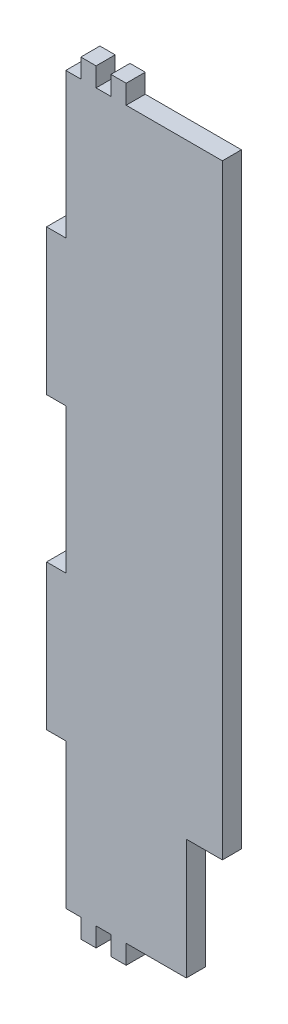
ISO-10303-21;
HEADER;
FILE_DESCRIPTION(('STEP AP214'),'2;1');
FILE_NAME('part.step','',(''),(''),'','','');
FILE_SCHEMA(('AUTOMOTIVE_DESIGN { 1 0 10303 214 1 1 1 1 }'));
ENDSEC;
DATA;
#1=APPLICATION_CONTEXT('core data for automotive mechanical design processes');
#2=APPLICATION_PROTOCOL_DEFINITION('international standard','automotive_design',2000,#1);
#3=PRODUCT_CONTEXT('',#1,'mechanical');
#4=PRODUCT('Part','Part','',(#3));
#5=PRODUCT_RELATED_PRODUCT_CATEGORY('part','',(#4));
#6=PRODUCT_DEFINITION_FORMATION('','',#4);
#7=PRODUCT_DEFINITION_CONTEXT('part definition',#1,'design');
#8=PRODUCT_DEFINITION('design','',#6,#7);
#9=PRODUCT_DEFINITION_SHAPE('','',#8);
#10=(LENGTH_UNIT() NAMED_UNIT(*) SI_UNIT(.MILLI.,.METRE.));
#11=(NAMED_UNIT(*) PLANE_ANGLE_UNIT() SI_UNIT($,.RADIAN.));
#12=(NAMED_UNIT(*) SI_UNIT($,.STERADIAN.) SOLID_ANGLE_UNIT());
#13=UNCERTAINTY_MEASURE_WITH_UNIT(LENGTH_MEASURE(1.E-05),#10,'distance_accuracy_value','');
#14=(GEOMETRIC_REPRESENTATION_CONTEXT(3) GLOBAL_UNCERTAINTY_ASSIGNED_CONTEXT((#13)) GLOBAL_UNIT_ASSIGNED_CONTEXT((#10,
#11,#12)) REPRESENTATION_CONTEXT('',''));
#15=CARTESIAN_POINT('',(0.,0.,0.));
#16=DIRECTION('',(0.,0.,1.));
#17=DIRECTION('',(1.,0.,0.));
#18=AXIS2_PLACEMENT_3D('',#15,#16,#17);
#19=CARTESIAN_POINT('',(27.54064,-80.70314,-260.74903958764));
#20=DIRECTION('',(0.,-1.,0.));
#21=DIRECTION('',(0.,0.,-1.));
#22=AXIS2_PLACEMENT_3D('',#19,#20,#21);
#23=PLANE('',#22);
#24=DIRECTION('',(-1.,0.,0.));
#25=VECTOR('',#24,1.);
#26=CARTESIAN_POINT('',(27.54064,-80.70314,0.));
#27=LINE('',#26,#25);
#28=CARTESIAN_POINT('',(39.54064,-80.70314,0.));
#29=VERTEX_POINT('',#28);
#30=CARTESIAN_POINT('',(27.54064,-80.70314,0.));
#31=VERTEX_POINT('',#30);
#32=EDGE_CURVE('E50',#29,#31,#27,.T.);
#33=ORIENTED_EDGE('',*,*,#32,.F.);
#34=DIRECTION('',(0.,0.,1.));
#35=VECTOR('',#34,1.);
#36=CARTESIAN_POINT('',(39.54064,-80.70314,-260.74903958764));
#37=LINE('',#36,#35);
#38=CARTESIAN_POINT('',(39.54064,-80.70314,6.35));
#39=VERTEX_POINT('',#38);
#40=EDGE_CURVE('E237',#29,#39,#37,.T.);
#41=ORIENTED_EDGE('',*,*,#40,.T.);
#42=DIRECTION('',(1.,0.,0.));
#43=VECTOR('',#42,1.);
#44=CARTESIAN_POINT('',(27.54064,-80.70314,6.35));
#45=LINE('',#44,#43);
#46=CARTESIAN_POINT('',(27.54064,-80.70314,6.35));
#47=VERTEX_POINT('',#46);
#48=EDGE_CURVE('E241',#47,#39,#45,.T.);
#49=ORIENTED_EDGE('',*,*,#48,.F.);
#50=DIRECTION('',(0.,0.,1.));
#51=VECTOR('',#50,1.);
#52=CARTESIAN_POINT('',(27.54064,-80.70314,-260.74903958764));
#53=LINE('',#52,#51);
#54=EDGE_CURVE('E373',#31,#47,#53,.T.);
#55=ORIENTED_EDGE('',*,*,#54,.F.);
#56=EDGE_LOOP('',(#33,#41,#49,#55));
#57=FACE_BOUND('',#56,.T.);
#58=ADVANCED_FACE('F41',(#57),#23,.T.);
#59=CARTESIAN_POINT('',(27.54064,-120.70314,-260.74903958764));
#60=DIRECTION('',(1.,0.,0.));
#61=DIRECTION('',(0.,0.,-1.));
#62=AXIS2_PLACEMENT_3D('',#59,#60,#61);
#63=PLANE('',#62);
#64=DIRECTION('',(0.,-1.,0.));
#65=VECTOR('',#64,1.);
#66=CARTESIAN_POINT('',(27.54064,-120.70314,0.));
#67=LINE('',#66,#65);
#68=CARTESIAN_POINT('',(27.54064,-120.70314,0.));
#69=VERTEX_POINT('',#68);
#70=EDGE_CURVE('E537',#31,#69,#67,.T.);
#71=ORIENTED_EDGE('',*,*,#70,.F.);
#72=ORIENTED_EDGE('',*,*,#54,.T.);
#73=DIRECTION('',(0.,1.,0.));
#74=VECTOR('',#73,1.);
#75=CARTESIAN_POINT('',(27.54064,-120.70314,6.35));
#76=LINE('',#75,#74);
#77=CARTESIAN_POINT('',(27.54064,-120.70314,6.35));
#78=VERTEX_POINT('',#77);
#79=EDGE_CURVE('E247',#78,#47,#76,.T.);
#80=ORIENTED_EDGE('',*,*,#79,.F.);
#81=DIRECTION('',(0.,0.,1.));
#82=VECTOR('',#81,1.);
#83=CARTESIAN_POINT('',(27.54064,-120.70314,-260.74903958764));
#84=LINE('',#83,#82);
#85=EDGE_CURVE('E377',#69,#78,#84,.T.);
#86=ORIENTED_EDGE('',*,*,#85,.F.);
#87=EDGE_LOOP('',(#71,#72,#80,#86));
#88=FACE_BOUND('',#87,.T.);
#89=ADVANCED_FACE('F544',(#88),#63,.T.);
#90=CARTESIAN_POINT('',(7.54064000000001,-120.70314,-260.74903958764));
#91=DIRECTION('',(0.,-1.,0.));
#92=DIRECTION('',(0.,0.,-1.));
#93=AXIS2_PLACEMENT_3D('',#90,#91,#92);
#94=PLANE('',#93);
#95=DIRECTION('',(-1.,0.,0.));
#96=VECTOR('',#95,1.);
#97=CARTESIAN_POINT('',(7.54064000000001,-120.70314,0.));
#98=LINE('',#97,#96);
#99=CARTESIAN_POINT('',(7.54064000000001,-120.70314,0.));
#100=VERTEX_POINT('',#99);
#101=EDGE_CURVE('E534',#69,#100,#98,.T.);
#102=ORIENTED_EDGE('',*,*,#101,.F.);
#103=ORIENTED_EDGE('',*,*,#85,.T.);
#104=DIRECTION('',(1.,0.,0.));
#105=VECTOR('',#104,1.);
#106=CARTESIAN_POINT('',(7.54064000000001,-120.70314,6.35));
#107=LINE('',#106,#105);
#108=CARTESIAN_POINT('',(7.54064000000001,-120.70314,6.35));
#109=VERTEX_POINT('',#108);
#110=EDGE_CURVE('E368',#109,#78,#107,.T.);
#111=ORIENTED_EDGE('',*,*,#110,.F.);
#112=DIRECTION('',(0.,0.,1.));
#113=VECTOR('',#112,1.);
#114=CARTESIAN_POINT('',(7.54064000000001,-120.70314,-260.74903958764));
#115=LINE('',#114,#113);
#116=EDGE_CURVE('E380',#100,#109,#115,.T.);
#117=ORIENTED_EDGE('',*,*,#116,.F.);
#118=EDGE_LOOP('',(#102,#103,#111,#117));
#119=FACE_BOUND('',#118,.T.);
#120=ADVANCED_FACE('F547',(#119),#94,.T.);
#121=CARTESIAN_POINT('',(7.54064000000001,-127.05314,-260.74903958764));
#122=DIRECTION('',(1.,0.,0.));
#123=DIRECTION('',(0.,0.,-1.));
#124=AXIS2_PLACEMENT_3D('',#121,#122,#123);
#125=PLANE('',#124);
#126=DIRECTION('',(0.,-1.,0.));
#127=VECTOR('',#126,1.);
#128=CARTESIAN_POINT('',(7.54064000000001,-127.05314,0.));
#129=LINE('',#128,#127);
#130=CARTESIAN_POINT('',(7.54064000000001,-127.05314,0.));
#131=VERTEX_POINT('',#130);
#132=EDGE_CURVE('E531',#100,#131,#129,.T.);
#133=ORIENTED_EDGE('',*,*,#132,.F.);
#134=ORIENTED_EDGE('',*,*,#116,.T.);
#135=DIRECTION('',(0.,1.,0.));
#136=VECTOR('',#135,1.);
#137=CARTESIAN_POINT('',(7.54064000000001,-127.05314,6.35));
#138=LINE('',#137,#136);
#139=CARTESIAN_POINT('',(7.54064000000001,-127.05314,6.35));
#140=VERTEX_POINT('',#139);
#141=EDGE_CURVE('E364',#140,#109,#138,.T.);
#142=ORIENTED_EDGE('',*,*,#141,.F.);
#143=DIRECTION('',(0.,0.,1.));
#144=VECTOR('',#143,1.);
#145=CARTESIAN_POINT('',(7.54064000000001,-127.05314,-260.74903958764));
#146=LINE('',#145,#144);
#147=EDGE_CURVE('E383',#131,#140,#146,.T.);
#148=ORIENTED_EDGE('',*,*,#147,.F.);
#149=EDGE_LOOP('',(#133,#134,#142,#148));
#150=FACE_BOUND('',#149,.T.);
#151=ADVANCED_FACE('F554',(#150),#125,.T.);
#152=CARTESIAN_POINT('',(2.45936000000001,-127.05314,-260.74903958764));
#153=DIRECTION('',(0.,-1.,0.));
#154=DIRECTION('',(1.,0.,0.));
#155=AXIS2_PLACEMENT_3D('',#152,#153,#154);
#156=PLANE('',#155);
#157=DIRECTION('',(-1.,0.,0.));
#158=VECTOR('',#157,1.);
#159=CARTESIAN_POINT('',(2.45936000000001,-127.05314,0.));
#160=LINE('',#159,#158);
#161=CARTESIAN_POINT('',(2.45936000000001,-127.05314,0.));
#162=VERTEX_POINT('',#161);
#163=EDGE_CURVE('E528',#131,#162,#160,.T.);
#164=ORIENTED_EDGE('',*,*,#163,.F.);
#165=ORIENTED_EDGE('',*,*,#147,.T.);
#166=DIRECTION('',(1.,0.,0.));
#167=VECTOR('',#166,1.);
#168=CARTESIAN_POINT('',(2.45936000000001,-127.05314,6.35));
#169=LINE('',#168,#167);
#170=CARTESIAN_POINT('',(2.45936000000001,-127.05314,6.35));
#171=VERTEX_POINT('',#170);
#172=EDGE_CURVE('E360',#171,#140,#169,.T.);
#173=ORIENTED_EDGE('',*,*,#172,.F.);
#174=DIRECTION('',(0.,0.,1.));
#175=VECTOR('',#174,1.);
#176=CARTESIAN_POINT('',(2.45936000000001,-127.05314,-260.74903958764));
#177=LINE('',#176,#175);
#178=EDGE_CURVE('E386',#162,#171,#177,.T.);
#179=ORIENTED_EDGE('',*,*,#178,.F.);
#180=EDGE_LOOP('',(#164,#165,#173,#179));
#181=FACE_BOUND('',#180,.T.);
#182=ADVANCED_FACE('F559',(#181),#156,.T.);
#183=CARTESIAN_POINT('',(2.45936000000001,-120.70314,-260.74903958764));
#184=DIRECTION('',(-1.,0.,0.));
#185=DIRECTION('',(0.,0.,1.));
#186=AXIS2_PLACEMENT_3D('',#183,#184,#185);
#187=PLANE('',#186);
#188=DIRECTION('',(0.,1.,0.));
#189=VECTOR('',#188,1.);
#190=CARTESIAN_POINT('',(2.45936000000001,-120.70314,0.));
#191=LINE('',#190,#189);
#192=CARTESIAN_POINT('',(2.45936000000001,-120.70314,0.));
#193=VERTEX_POINT('',#192);
#194=EDGE_CURVE('E525',#162,#193,#191,.T.);
#195=ORIENTED_EDGE('',*,*,#194,.F.);
#196=ORIENTED_EDGE('',*,*,#178,.T.);
#197=DIRECTION('',(0.,-1.,0.));
#198=VECTOR('',#197,1.);
#199=CARTESIAN_POINT('',(2.45936000000001,-120.70314,6.35));
#200=LINE('',#199,#198);
#201=CARTESIAN_POINT('',(2.45936000000001,-120.70314,6.35));
#202=VERTEX_POINT('',#201);
#203=EDGE_CURVE('E356',#202,#171,#200,.T.);
#204=ORIENTED_EDGE('',*,*,#203,.F.);
#205=DIRECTION('',(0.,0.,1.));
#206=VECTOR('',#205,1.);
#207=CARTESIAN_POINT('',(2.45936000000001,-120.70314,-260.74903958764));
#208=LINE('',#207,#206);
#209=EDGE_CURVE('E389',#193,#202,#208,.T.);
#210=ORIENTED_EDGE('',*,*,#209,.F.);
#211=EDGE_LOOP('',(#195,#196,#204,#210));
#212=FACE_BOUND('',#211,.T.);
#213=ADVANCED_FACE('F562',(#212),#187,.T.);
#214=CARTESIAN_POINT('',(-2.45935999999999,-120.70314,-260.74903958764));
#215=DIRECTION('',(0.,-1.,0.));
#216=DIRECTION('',(0.,0.,-1.));
#217=AXIS2_PLACEMENT_3D('',#214,#215,#216);
#218=PLANE('',#217);
#219=DIRECTION('',(-1.,0.,0.));
#220=VECTOR('',#219,1.);
#221=CARTESIAN_POINT('',(-2.45935999999999,-120.70314,0.));
#222=LINE('',#221,#220);
#223=CARTESIAN_POINT('',(-2.45935999999999,-120.70314,0.));
#224=VERTEX_POINT('',#223);
#225=EDGE_CURVE('E522',#193,#224,#222,.T.);
#226=ORIENTED_EDGE('',*,*,#225,.F.);
#227=ORIENTED_EDGE('',*,*,#209,.T.);
#228=DIRECTION('',(1.,0.,0.));
#229=VECTOR('',#228,1.);
#230=CARTESIAN_POINT('',(-2.45935999999999,-120.70314,6.35));
#231=LINE('',#230,#229);
#232=CARTESIAN_POINT('',(-2.45935999999999,-120.70314,6.35));
#233=VERTEX_POINT('',#232);
#234=EDGE_CURVE('E352',#233,#202,#231,.T.);
#235=ORIENTED_EDGE('',*,*,#234,.F.);
#236=DIRECTION('',(0.,0.,1.));
#237=VECTOR('',#236,1.);
#238=CARTESIAN_POINT('',(-2.45935999999999,-120.70314,-260.74903958764));
#239=LINE('',#238,#237);
#240=EDGE_CURVE('E392',#224,#233,#239,.T.);
#241=ORIENTED_EDGE('',*,*,#240,.F.);
#242=EDGE_LOOP('',(#226,#227,#235,#241));
#243=FACE_BOUND('',#242,.T.);
#244=ADVANCED_FACE('F568',(#243),#218,.T.);
#245=CARTESIAN_POINT('',(-2.45935999999999,-127.05314,-260.74903958764));
#246=DIRECTION('',(1.,0.,0.));
#247=DIRECTION('',(0.,0.,-1.));
#248=AXIS2_PLACEMENT_3D('',#245,#246,#247);
#249=PLANE('',#248);
#250=DIRECTION('',(0.,-1.,0.));
#251=VECTOR('',#250,1.);
#252=CARTESIAN_POINT('',(-2.45935999999999,-127.05314,0.));
#253=LINE('',#252,#251);
#254=CARTESIAN_POINT('',(-2.45935999999999,-127.05314,0.));
#255=VERTEX_POINT('',#254);
#256=EDGE_CURVE('E519',#224,#255,#253,.T.);
#257=ORIENTED_EDGE('',*,*,#256,.F.);
#258=ORIENTED_EDGE('',*,*,#240,.T.);
#259=DIRECTION('',(0.,1.,0.));
#260=VECTOR('',#259,1.);
#261=CARTESIAN_POINT('',(-2.45935999999999,-127.05314,6.35));
#262=LINE('',#261,#260);
#263=CARTESIAN_POINT('',(-2.45935999999999,-127.05314,6.35));
#264=VERTEX_POINT('',#263);
#265=EDGE_CURVE('E348',#264,#233,#262,.T.);
#266=ORIENTED_EDGE('',*,*,#265,.F.);
#267=DIRECTION('',(0.,0.,1.));
#268=VECTOR('',#267,1.);
#269=CARTESIAN_POINT('',(-2.45935999999999,-127.05314,-260.74903958764));
#270=LINE('',#269,#268);
#271=EDGE_CURVE('E395',#255,#264,#270,.T.);
#272=ORIENTED_EDGE('',*,*,#271,.F.);
#273=EDGE_LOOP('',(#257,#258,#266,#272));
#274=FACE_BOUND('',#273,.T.);
#275=ADVANCED_FACE('F572',(#274),#249,.T.);
#276=CARTESIAN_POINT('',(-7.54063999999999,-127.05314,-260.74903958764));
#277=DIRECTION('',(0.,-1.,0.));
#278=DIRECTION('',(1.,0.,0.));
#279=AXIS2_PLACEMENT_3D('',#276,#277,#278);
#280=PLANE('',#279);
#281=DIRECTION('',(-1.,0.,0.));
#282=VECTOR('',#281,1.);
#283=CARTESIAN_POINT('',(-7.54063999999999,-127.05314,0.));
#284=LINE('',#283,#282);
#285=CARTESIAN_POINT('',(-7.54063999999999,-127.05314,0.));
#286=VERTEX_POINT('',#285);
#287=EDGE_CURVE('E516',#255,#286,#284,.T.);
#288=ORIENTED_EDGE('',*,*,#287,.F.);
#289=ORIENTED_EDGE('',*,*,#271,.T.);
#290=DIRECTION('',(1.,0.,0.));
#291=VECTOR('',#290,1.);
#292=CARTESIAN_POINT('',(-7.54063999999999,-127.05314,6.35));
#293=LINE('',#292,#291);
#294=CARTESIAN_POINT('',(-7.54063999999999,-127.05314,6.35));
#295=VERTEX_POINT('',#294);
#296=EDGE_CURVE('E344',#295,#264,#293,.T.);
#297=ORIENTED_EDGE('',*,*,#296,.F.);
#298=DIRECTION('',(0.,0.,1.));
#299=VECTOR('',#298,1.);
#300=CARTESIAN_POINT('',(-7.54063999999999,-127.05314,-260.74903958764));
#301=LINE('',#300,#299);
#302=EDGE_CURVE('E398',#286,#295,#301,.T.);
#303=ORIENTED_EDGE('',*,*,#302,.F.);
#304=EDGE_LOOP('',(#288,#289,#297,#303));
#305=FACE_BOUND('',#304,.T.);
#306=ADVANCED_FACE('F578',(#305),#280,.T.);
#307=CARTESIAN_POINT('',(-7.54063999999999,-120.70314,-260.74903958764));
#308=DIRECTION('',(-1.,0.,0.));
#309=DIRECTION('',(0.,0.,1.));
#310=AXIS2_PLACEMENT_3D('',#307,#308,#309);
#311=PLANE('',#310);
#312=DIRECTION('',(0.,1.,0.));
#313=VECTOR('',#312,1.);
#314=CARTESIAN_POINT('',(-7.54063999999999,-120.70314,0.));
#315=LINE('',#314,#313);
#316=CARTESIAN_POINT('',(-7.54063999999999,-120.70314,0.));
#317=VERTEX_POINT('',#316);
#318=EDGE_CURVE('E513',#286,#317,#315,.T.);
#319=ORIENTED_EDGE('',*,*,#318,.F.);
#320=ORIENTED_EDGE('',*,*,#302,.T.);
#321=DIRECTION('',(0.,-1.,0.));
#322=VECTOR('',#321,1.);
#323=CARTESIAN_POINT('',(-7.54063999999999,-120.70314,6.35));
#324=LINE('',#323,#322);
#325=CARTESIAN_POINT('',(-7.54063999999999,-120.70314,6.35));
#326=VERTEX_POINT('',#325);
#327=EDGE_CURVE('E340',#326,#295,#324,.T.);
#328=ORIENTED_EDGE('',*,*,#327,.F.);
#329=DIRECTION('',(0.,0.,1.));
#330=VECTOR('',#329,1.);
#331=CARTESIAN_POINT('',(-7.54063999999999,-120.70314,-260.74903958764));
#332=LINE('',#331,#330);
#333=EDGE_CURVE('E401',#317,#326,#332,.T.);
#334=ORIENTED_EDGE('',*,*,#333,.F.);
#335=EDGE_LOOP('',(#319,#320,#328,#334));
#336=FACE_BOUND('',#335,.T.);
#337=ADVANCED_FACE('F582',(#336),#311,.T.);
#338=CARTESIAN_POINT('',(-12.54064,-120.70314,-260.74903958764));
#339=DIRECTION('',(0.,-1.,0.));
#340=DIRECTION('',(0.,0.,-1.));
#341=AXIS2_PLACEMENT_3D('',#338,#339,#340);
#342=PLANE('',#341);
#343=DIRECTION('',(-1.,0.,0.));
#344=VECTOR('',#343,1.);
#345=CARTESIAN_POINT('',(-12.54064,-120.70314,0.));
#346=LINE('',#345,#344);
#347=CARTESIAN_POINT('',(-12.54064,-120.70314,0.));
#348=VERTEX_POINT('',#347);
#349=EDGE_CURVE('E510',#317,#348,#346,.T.);
#350=ORIENTED_EDGE('',*,*,#349,.F.);
#351=ORIENTED_EDGE('',*,*,#333,.T.);
#352=DIRECTION('',(1.,0.,0.));
#353=VECTOR('',#352,1.);
#354=CARTESIAN_POINT('',(-12.54064,-120.70314,6.35));
#355=LINE('',#354,#353);
#356=CARTESIAN_POINT('',(-12.54064,-120.70314,6.35));
#357=VERTEX_POINT('',#356);
#358=EDGE_CURVE('E336',#357,#326,#355,.T.);
#359=ORIENTED_EDGE('',*,*,#358,.F.);
#360=DIRECTION('',(0.,0.,1.));
#361=VECTOR('',#360,1.);
#362=CARTESIAN_POINT('',(-12.54064,-120.70314,-260.74903958764));
#363=LINE('',#362,#361);
#364=EDGE_CURVE('E404',#348,#357,#363,.T.);
#365=ORIENTED_EDGE('',*,*,#364,.F.);
#366=EDGE_LOOP('',(#350,#351,#359,#365));
#367=FACE_BOUND('',#366,.T.);
#368=ADVANCED_FACE('F588',(#367),#342,.T.);
#369=CARTESIAN_POINT('',(-12.54064,-72.43814,-260.74903958764));
#370=DIRECTION('',(-1.,0.,0.));
#371=DIRECTION('',(0.,0.,1.));
#372=AXIS2_PLACEMENT_3D('',#369,#370,#371);
#373=PLANE('',#372);
#374=DIRECTION('',(0.,1.,0.));
#375=VECTOR('',#374,1.);
#376=CARTESIAN_POINT('',(-12.54064,-72.43814,0.));
#377=LINE('',#376,#375);
#378=CARTESIAN_POINT('',(-12.54064,-72.43814,0.));
#379=VERTEX_POINT('',#378);
#380=EDGE_CURVE('E507',#348,#379,#377,.T.);
#381=ORIENTED_EDGE('',*,*,#380,.F.);
#382=ORIENTED_EDGE('',*,*,#364,.T.);
#383=DIRECTION('',(0.,-1.,0.));
#384=VECTOR('',#383,1.);
#385=CARTESIAN_POINT('',(-12.54064,-72.43814,6.35));
#386=LINE('',#385,#384);
#387=CARTESIAN_POINT('',(-12.54064,-72.43814,6.35));
#388=VERTEX_POINT('',#387);
#389=EDGE_CURVE('E332',#388,#357,#386,.T.);
#390=ORIENTED_EDGE('',*,*,#389,.F.);
#391=DIRECTION('',(0.,0.,1.));
#392=VECTOR('',#391,1.);
#393=CARTESIAN_POINT('',(-12.54064,-72.43814,-260.74903958764));
#394=LINE('',#393,#392);
#395=EDGE_CURVE('E407',#379,#388,#394,.T.);
#396=ORIENTED_EDGE('',*,*,#395,.F.);
#397=EDGE_LOOP('',(#381,#382,#390,#396));
#398=FACE_BOUND('',#397,.T.);
#399=ADVANCED_FACE('F592',(#398),#373,.T.);
#400=CARTESIAN_POINT('',(-18.94064,-72.43814,-260.74903958764));
#401=DIRECTION('',(0.,-1.,0.));
#402=DIRECTION('',(0.,0.,-1.));
#403=AXIS2_PLACEMENT_3D('',#400,#401,#402);
#404=PLANE('',#403);
#405=DIRECTION('',(-1.,0.,0.));
#406=VECTOR('',#405,1.);
#407=CARTESIAN_POINT('',(-18.94064,-72.43814,0.));
#408=LINE('',#407,#406);
#409=CARTESIAN_POINT('',(-18.94064,-72.43814,0.));
#410=VERTEX_POINT('',#409);
#411=EDGE_CURVE('E504',#379,#410,#408,.T.);
#412=ORIENTED_EDGE('',*,*,#411,.F.);
#413=ORIENTED_EDGE('',*,*,#395,.T.);
#414=DIRECTION('',(1.,0.,0.));
#415=VECTOR('',#414,1.);
#416=CARTESIAN_POINT('',(-18.94064,-72.43814,6.35));
#417=LINE('',#416,#415);
#418=CARTESIAN_POINT('',(-18.94064,-72.43814,6.35));
#419=VERTEX_POINT('',#418);
#420=EDGE_CURVE('E328',#419,#388,#417,.T.);
#421=ORIENTED_EDGE('',*,*,#420,.F.);
#422=DIRECTION('',(0.,0.,1.));
#423=VECTOR('',#422,1.);
#424=CARTESIAN_POINT('',(-18.94064,-72.43814,-260.74903958764));
#425=LINE('',#424,#423);
#426=EDGE_CURVE('E410',#410,#419,#425,.T.);
#427=ORIENTED_EDGE('',*,*,#426,.F.);
#428=EDGE_LOOP('',(#412,#413,#421,#427));
#429=FACE_BOUND('',#428,.T.);
#430=ADVANCED_FACE('F598',(#429),#404,.T.);
#431=CARTESIAN_POINT('',(-18.94064,-24.09186,-260.74903958764));
#432=DIRECTION('',(-1.,0.,0.));
#433=DIRECTION('',(0.,-1.,0.));
#434=AXIS2_PLACEMENT_3D('',#431,#432,#433);
#435=PLANE('',#434);
#436=DIRECTION('',(0.,1.,0.));
#437=VECTOR('',#436,1.);
#438=CARTESIAN_POINT('',(-18.94064,-24.09186,0.));
#439=LINE('',#438,#437);
#440=CARTESIAN_POINT('',(-18.94064,-24.09186,0.));
#441=VERTEX_POINT('',#440);
#442=EDGE_CURVE('E501',#410,#441,#439,.T.);
#443=ORIENTED_EDGE('',*,*,#442,.F.);
#444=ORIENTED_EDGE('',*,*,#426,.T.);
#445=DIRECTION('',(0.,-1.,0.));
#446=VECTOR('',#445,1.);
#447=CARTESIAN_POINT('',(-18.94064,-24.09186,6.35));
#448=LINE('',#447,#446);
#449=CARTESIAN_POINT('',(-18.94064,-24.09186,6.35));
#450=VERTEX_POINT('',#449);
#451=EDGE_CURVE('E324',#450,#419,#448,.T.);
#452=ORIENTED_EDGE('',*,*,#451,.F.);
#453=DIRECTION('',(0.,0.,1.));
#454=VECTOR('',#453,1.);
#455=CARTESIAN_POINT('',(-18.94064,-24.09186,-260.74903958764));
#456=LINE('',#455,#454);
#457=EDGE_CURVE('E413',#441,#450,#456,.T.);
#458=ORIENTED_EDGE('',*,*,#457,.F.);
#459=EDGE_LOOP('',(#443,#444,#452,#458));
#460=FACE_BOUND('',#459,.T.);
#461=ADVANCED_FACE('F602',(#460),#435,.T.);
#462=CARTESIAN_POINT('',(-12.54064,-24.09186,-260.74903958764));
#463=DIRECTION('',(0.,1.,0.));
#464=DIRECTION('',(-1.,0.,0.));
#465=AXIS2_PLACEMENT_3D('',#462,#463,#464);
#466=PLANE('',#465);
#467=DIRECTION('',(1.,0.,0.));
#468=VECTOR('',#467,1.);
#469=CARTESIAN_POINT('',(-12.54064,-24.09186,0.));
#470=LINE('',#469,#468);
#471=CARTESIAN_POINT('',(-12.54064,-24.09186,0.));
#472=VERTEX_POINT('',#471);
#473=EDGE_CURVE('E498',#441,#472,#470,.T.);
#474=ORIENTED_EDGE('',*,*,#473,.F.);
#475=ORIENTED_EDGE('',*,*,#457,.T.);
#476=DIRECTION('',(-1.,0.,0.));
#477=VECTOR('',#476,1.);
#478=CARTESIAN_POINT('',(-12.54064,-24.09186,6.35));
#479=LINE('',#478,#477);
#480=CARTESIAN_POINT('',(-12.54064,-24.09186,6.35));
#481=VERTEX_POINT('',#480);
#482=EDGE_CURVE('E320',#481,#450,#479,.T.);
#483=ORIENTED_EDGE('',*,*,#482,.F.);
#484=DIRECTION('',(0.,0.,1.));
#485=VECTOR('',#484,1.);
#486=CARTESIAN_POINT('',(-12.54064,-24.09186,-260.74903958764));
#487=LINE('',#486,#485);
#488=EDGE_CURVE('E416',#472,#481,#487,.T.);
#489=ORIENTED_EDGE('',*,*,#488,.F.);
#490=EDGE_LOOP('',(#474,#475,#483,#489));
#491=FACE_BOUND('',#490,.T.);
#492=ADVANCED_FACE('F608',(#491),#466,.T.);
#493=CARTESIAN_POINT('',(-12.54064,24.09186,-260.74903958764));
#494=DIRECTION('',(-1.,0.,0.));
#495=DIRECTION('',(0.,0.,1.));
#496=AXIS2_PLACEMENT_3D('',#493,#494,#495);
#497=PLANE('',#496);
#498=DIRECTION('',(0.,1.,0.));
#499=VECTOR('',#498,1.);
#500=CARTESIAN_POINT('',(-12.54064,24.09186,0.));
#501=LINE('',#500,#499);
#502=CARTESIAN_POINT('',(-12.54064,24.09186,0.));
#503=VERTEX_POINT('',#502);
#504=EDGE_CURVE('E495',#472,#503,#501,.T.);
#505=ORIENTED_EDGE('',*,*,#504,.F.);
#506=ORIENTED_EDGE('',*,*,#488,.T.);
#507=DIRECTION('',(0.,-1.,0.));
#508=VECTOR('',#507,1.);
#509=CARTESIAN_POINT('',(-12.54064,24.09186,6.35));
#510=LINE('',#509,#508);
#511=CARTESIAN_POINT('',(-12.54064,24.09186,6.35));
#512=VERTEX_POINT('',#511);
#513=EDGE_CURVE('E316',#512,#481,#510,.T.);
#514=ORIENTED_EDGE('',*,*,#513,.F.);
#515=DIRECTION('',(0.,0.,1.));
#516=VECTOR('',#515,1.);
#517=CARTESIAN_POINT('',(-12.54064,24.09186,-260.74903958764));
#518=LINE('',#517,#516);
#519=EDGE_CURVE('E419',#503,#512,#518,.T.);
#520=ORIENTED_EDGE('',*,*,#519,.F.);
#521=EDGE_LOOP('',(#505,#506,#514,#520));
#522=FACE_BOUND('',#521,.T.);
#523=ADVANCED_FACE('F612',(#522),#497,.T.);
#524=CARTESIAN_POINT('',(-18.94064,24.09186,-260.74903958764));
#525=DIRECTION('',(0.,-1.,0.));
#526=DIRECTION('',(0.,0.,-1.));
#527=AXIS2_PLACEMENT_3D('',#524,#525,#526);
#528=PLANE('',#527);
#529=DIRECTION('',(-1.,0.,0.));
#530=VECTOR('',#529,1.);
#531=CARTESIAN_POINT('',(-18.94064,24.09186,0.));
#532=LINE('',#531,#530);
#533=CARTESIAN_POINT('',(-18.94064,24.09186,0.));
#534=VERTEX_POINT('',#533);
#535=EDGE_CURVE('E492',#503,#534,#532,.T.);
#536=ORIENTED_EDGE('',*,*,#535,.F.);
#537=ORIENTED_EDGE('',*,*,#519,.T.);
#538=DIRECTION('',(1.,0.,0.));
#539=VECTOR('',#538,1.);
#540=CARTESIAN_POINT('',(-18.94064,24.09186,6.35));
#541=LINE('',#540,#539);
#542=CARTESIAN_POINT('',(-18.94064,24.09186,6.35));
#543=VERTEX_POINT('',#542);
#544=EDGE_CURVE('E312',#543,#512,#541,.T.);
#545=ORIENTED_EDGE('',*,*,#544,.F.);
#546=DIRECTION('',(0.,0.,1.));
#547=VECTOR('',#546,1.);
#548=CARTESIAN_POINT('',(-18.94064,24.09186,-260.74903958764));
#549=LINE('',#548,#547);
#550=EDGE_CURVE('E422',#534,#543,#549,.T.);
#551=ORIENTED_EDGE('',*,*,#550,.F.);
#552=EDGE_LOOP('',(#536,#537,#545,#551));
#553=FACE_BOUND('',#552,.T.);
#554=ADVANCED_FACE('F618',(#553),#528,.T.);
#555=CARTESIAN_POINT('',(-18.94064,72.43814,-260.74903958764));
#556=DIRECTION('',(-1.,0.,0.));
#557=DIRECTION('',(0.,-1.,0.));
#558=AXIS2_PLACEMENT_3D('',#555,#556,#557);
#559=PLANE('',#558);
#560=DIRECTION('',(0.,1.,0.));
#561=VECTOR('',#560,1.);
#562=CARTESIAN_POINT('',(-18.94064,72.43814,0.));
#563=LINE('',#562,#561);
#564=CARTESIAN_POINT('',(-18.94064,72.43814,0.));
#565=VERTEX_POINT('',#564);
#566=EDGE_CURVE('E489',#534,#565,#563,.T.);
#567=ORIENTED_EDGE('',*,*,#566,.F.);
#568=ORIENTED_EDGE('',*,*,#550,.T.);
#569=DIRECTION('',(0.,-1.,0.));
#570=VECTOR('',#569,1.);
#571=CARTESIAN_POINT('',(-18.94064,72.43814,6.35));
#572=LINE('',#571,#570);
#573=CARTESIAN_POINT('',(-18.94064,72.43814,6.35));
#574=VERTEX_POINT('',#573);
#575=EDGE_CURVE('E308',#574,#543,#572,.T.);
#576=ORIENTED_EDGE('',*,*,#575,.F.);
#577=DIRECTION('',(0.,0.,1.));
#578=VECTOR('',#577,1.);
#579=CARTESIAN_POINT('',(-18.94064,72.43814,-260.74903958764));
#580=LINE('',#579,#578);
#581=EDGE_CURVE('E425',#565,#574,#580,.T.);
#582=ORIENTED_EDGE('',*,*,#581,.F.);
#583=EDGE_LOOP('',(#567,#568,#576,#582));
#584=FACE_BOUND('',#583,.T.);
#585=ADVANCED_FACE('F622',(#584),#559,.T.);
#586=CARTESIAN_POINT('',(-12.54064,72.43814,-260.74903958764));
#587=DIRECTION('',(0.,1.,0.));
#588=DIRECTION('',(0.,0.,1.));
#589=AXIS2_PLACEMENT_3D('',#586,#587,#588);
#590=PLANE('',#589);
#591=DIRECTION('',(1.,0.,0.));
#592=VECTOR('',#591,1.);
#593=CARTESIAN_POINT('',(-12.54064,72.43814,0.));
#594=LINE('',#593,#592);
#595=CARTESIAN_POINT('',(-12.54064,72.43814,0.));
#596=VERTEX_POINT('',#595);
#597=EDGE_CURVE('E486',#565,#596,#594,.T.);
#598=ORIENTED_EDGE('',*,*,#597,.F.);
#599=ORIENTED_EDGE('',*,*,#581,.T.);
#600=DIRECTION('',(-1.,0.,0.));
#601=VECTOR('',#600,1.);
#602=CARTESIAN_POINT('',(-12.54064,72.43814,6.35));
#603=LINE('',#602,#601);
#604=CARTESIAN_POINT('',(-12.54064,72.43814,6.35));
#605=VERTEX_POINT('',#604);
#606=EDGE_CURVE('E304',#605,#574,#603,.T.);
#607=ORIENTED_EDGE('',*,*,#606,.F.);
#608=DIRECTION('',(0.,0.,1.));
#609=VECTOR('',#608,1.);
#610=CARTESIAN_POINT('',(-12.54064,72.43814,-260.74903958764));
#611=LINE('',#610,#609);
#612=EDGE_CURVE('E428',#596,#605,#611,.T.);
#613=ORIENTED_EDGE('',*,*,#612,.F.);
#614=EDGE_LOOP('',(#598,#599,#607,#613));
#615=FACE_BOUND('',#614,.T.);
#616=ADVANCED_FACE('F628',(#615),#590,.T.);
#617=CARTESIAN_POINT('',(-12.54064,120.70314,-260.74903958764));
#618=DIRECTION('',(-1.,0.,0.));
#619=DIRECTION('',(0.,0.,1.));
#620=AXIS2_PLACEMENT_3D('',#617,#618,#619);
#621=PLANE('',#620);
#622=DIRECTION('',(0.,1.,0.));
#623=VECTOR('',#622,1.);
#624=CARTESIAN_POINT('',(-12.54064,120.70314,0.));
#625=LINE('',#624,#623);
#626=CARTESIAN_POINT('',(-12.54064,120.70314,0.));
#627=VERTEX_POINT('',#626);
#628=EDGE_CURVE('E483',#596,#627,#625,.T.);
#629=ORIENTED_EDGE('',*,*,#628,.F.);
#630=ORIENTED_EDGE('',*,*,#612,.T.);
#631=DIRECTION('',(0.,-1.,0.));
#632=VECTOR('',#631,1.);
#633=CARTESIAN_POINT('',(-12.54064,120.70314,6.35));
#634=LINE('',#633,#632);
#635=CARTESIAN_POINT('',(-12.54064,120.70314,6.35));
#636=VERTEX_POINT('',#635);
#637=EDGE_CURVE('E300',#636,#605,#634,.T.);
#638=ORIENTED_EDGE('',*,*,#637,.F.);
#639=DIRECTION('',(0.,0.,1.));
#640=VECTOR('',#639,1.);
#641=CARTESIAN_POINT('',(-12.54064,120.70314,-260.74903958764));
#642=LINE('',#641,#640);
#643=EDGE_CURVE('E431',#627,#636,#642,.T.);
#644=ORIENTED_EDGE('',*,*,#643,.F.);
#645=EDGE_LOOP('',(#629,#630,#638,#644));
#646=FACE_BOUND('',#645,.T.);
#647=ADVANCED_FACE('F632',(#646),#621,.T.);
#648=CARTESIAN_POINT('',(-7.54063999999999,120.70314,-260.74903958764));
#649=DIRECTION('',(0.,1.,0.));
#650=DIRECTION('',(0.,0.,1.));
#651=AXIS2_PLACEMENT_3D('',#648,#649,#650);
#652=PLANE('',#651);
#653=DIRECTION('',(1.,0.,0.));
#654=VECTOR('',#653,1.);
#655=CARTESIAN_POINT('',(-7.54063999999999,120.70314,0.));
#656=LINE('',#655,#654);
#657=CARTESIAN_POINT('',(-7.54063999999999,120.70314,0.));
#658=VERTEX_POINT('',#657);
#659=EDGE_CURVE('E480',#627,#658,#656,.T.);
#660=ORIENTED_EDGE('',*,*,#659,.F.);
#661=ORIENTED_EDGE('',*,*,#643,.T.);
#662=DIRECTION('',(-1.,0.,0.));
#663=VECTOR('',#662,1.);
#664=CARTESIAN_POINT('',(-7.54063999999999,120.70314,6.35));
#665=LINE('',#664,#663);
#666=CARTESIAN_POINT('',(-7.54063999999999,120.70314,6.35));
#667=VERTEX_POINT('',#666);
#668=EDGE_CURVE('E296',#667,#636,#665,.T.);
#669=ORIENTED_EDGE('',*,*,#668,.F.);
#670=DIRECTION('',(0.,0.,1.));
#671=VECTOR('',#670,1.);
#672=CARTESIAN_POINT('',(-7.54063999999999,120.70314,-260.74903958764));
#673=LINE('',#672,#671);
#674=EDGE_CURVE('E434',#658,#667,#673,.T.);
#675=ORIENTED_EDGE('',*,*,#674,.F.);
#676=EDGE_LOOP('',(#660,#661,#669,#675));
#677=FACE_BOUND('',#676,.T.);
#678=ADVANCED_FACE('F638',(#677),#652,.T.);
#679=CARTESIAN_POINT('',(-7.54063999999999,127.05314,-260.74903958764));
#680=DIRECTION('',(-1.,0.,0.));
#681=DIRECTION('',(0.,0.,1.));
#682=AXIS2_PLACEMENT_3D('',#679,#680,#681);
#683=PLANE('',#682);
#684=DIRECTION('',(0.,1.,0.));
#685=VECTOR('',#684,1.);
#686=CARTESIAN_POINT('',(-7.54063999999999,127.05314,0.));
#687=LINE('',#686,#685);
#688=CARTESIAN_POINT('',(-7.54063999999999,127.05314,0.));
#689=VERTEX_POINT('',#688);
#690=EDGE_CURVE('E477',#658,#689,#687,.T.);
#691=ORIENTED_EDGE('',*,*,#690,.F.);
#692=ORIENTED_EDGE('',*,*,#674,.T.);
#693=DIRECTION('',(0.,-1.,0.));
#694=VECTOR('',#693,1.);
#695=CARTESIAN_POINT('',(-7.54063999999999,127.05314,6.35));
#696=LINE('',#695,#694);
#697=CARTESIAN_POINT('',(-7.54063999999999,127.05314,6.35));
#698=VERTEX_POINT('',#697);
#699=EDGE_CURVE('E292',#698,#667,#696,.T.);
#700=ORIENTED_EDGE('',*,*,#699,.F.);
#701=DIRECTION('',(0.,0.,1.));
#702=VECTOR('',#701,1.);
#703=CARTESIAN_POINT('',(-7.54063999999999,127.05314,-260.74903958764));
#704=LINE('',#703,#702);
#705=EDGE_CURVE('E437',#689,#698,#704,.T.);
#706=ORIENTED_EDGE('',*,*,#705,.F.);
#707=EDGE_LOOP('',(#691,#692,#700,#706));
#708=FACE_BOUND('',#707,.T.);
#709=ADVANCED_FACE('F642',(#708),#683,.T.);
#710=CARTESIAN_POINT('',(-2.45935999999999,127.05314,-260.74903958764));
#711=DIRECTION('',(0.,1.,0.));
#712=DIRECTION('',(-1.,0.,0.));
#713=AXIS2_PLACEMENT_3D('',#710,#711,#712);
#714=PLANE('',#713);
#715=DIRECTION('',(1.,0.,0.));
#716=VECTOR('',#715,1.);
#717=CARTESIAN_POINT('',(-2.45935999999999,127.05314,0.));
#718=LINE('',#717,#716);
#719=CARTESIAN_POINT('',(-2.45935999999999,127.05314,0.));
#720=VERTEX_POINT('',#719);
#721=EDGE_CURVE('E474',#689,#720,#718,.T.);
#722=ORIENTED_EDGE('',*,*,#721,.F.);
#723=ORIENTED_EDGE('',*,*,#705,.T.);
#724=DIRECTION('',(-1.,0.,0.));
#725=VECTOR('',#724,1.);
#726=CARTESIAN_POINT('',(-2.45935999999999,127.05314,6.35));
#727=LINE('',#726,#725);
#728=CARTESIAN_POINT('',(-2.45935999999999,127.05314,6.35));
#729=VERTEX_POINT('',#728);
#730=EDGE_CURVE('E288',#729,#698,#727,.T.);
#731=ORIENTED_EDGE('',*,*,#730,.F.);
#732=DIRECTION('',(0.,0.,1.));
#733=VECTOR('',#732,1.);
#734=CARTESIAN_POINT('',(-2.45935999999999,127.05314,-260.74903958764));
#735=LINE('',#734,#733);
#736=EDGE_CURVE('E440',#720,#729,#735,.T.);
#737=ORIENTED_EDGE('',*,*,#736,.F.);
#738=EDGE_LOOP('',(#722,#723,#731,#737));
#739=FACE_BOUND('',#738,.T.);
#740=ADVANCED_FACE('F648',(#739),#714,.T.);
#741=CARTESIAN_POINT('',(-2.45935999999999,120.70314,-260.74903958764));
#742=DIRECTION('',(1.,0.,0.));
#743=DIRECTION('',(0.,0.,-1.));
#744=AXIS2_PLACEMENT_3D('',#741,#742,#743);
#745=PLANE('',#744);
#746=DIRECTION('',(0.,-1.,0.));
#747=VECTOR('',#746,1.);
#748=CARTESIAN_POINT('',(-2.45935999999999,120.70314,0.));
#749=LINE('',#748,#747);
#750=CARTESIAN_POINT('',(-2.45935999999999,120.70314,0.));
#751=VERTEX_POINT('',#750);
#752=EDGE_CURVE('E471',#720,#751,#749,.T.);
#753=ORIENTED_EDGE('',*,*,#752,.F.);
#754=ORIENTED_EDGE('',*,*,#736,.T.);
#755=DIRECTION('',(0.,1.,0.));
#756=VECTOR('',#755,1.);
#757=CARTESIAN_POINT('',(-2.45935999999999,120.70314,6.35));
#758=LINE('',#757,#756);
#759=CARTESIAN_POINT('',(-2.45935999999999,120.70314,6.35));
#760=VERTEX_POINT('',#759);
#761=EDGE_CURVE('E284',#760,#729,#758,.T.);
#762=ORIENTED_EDGE('',*,*,#761,.F.);
#763=DIRECTION('',(0.,0.,1.));
#764=VECTOR('',#763,1.);
#765=CARTESIAN_POINT('',(-2.45935999999999,120.70314,-260.74903958764));
#766=LINE('',#765,#764);
#767=EDGE_CURVE('E443',#751,#760,#766,.T.);
#768=ORIENTED_EDGE('',*,*,#767,.F.);
#769=EDGE_LOOP('',(#753,#754,#762,#768));
#770=FACE_BOUND('',#769,.T.);
#771=ADVANCED_FACE('F652',(#770),#745,.T.);
#772=CARTESIAN_POINT('',(2.45936000000001,120.70314,-260.74903958764));
#773=DIRECTION('',(0.,1.,0.));
#774=DIRECTION('',(0.,0.,1.));
#775=AXIS2_PLACEMENT_3D('',#772,#773,#774);
#776=PLANE('',#775);
#777=DIRECTION('',(1.,0.,0.));
#778=VECTOR('',#777,1.);
#779=CARTESIAN_POINT('',(2.45936000000001,120.70314,0.));
#780=LINE('',#779,#778);
#781=CARTESIAN_POINT('',(2.45936000000001,120.70314,0.));
#782=VERTEX_POINT('',#781);
#783=EDGE_CURVE('E468',#751,#782,#780,.T.);
#784=ORIENTED_EDGE('',*,*,#783,.F.);
#785=ORIENTED_EDGE('',*,*,#767,.T.);
#786=DIRECTION('',(-1.,0.,0.));
#787=VECTOR('',#786,1.);
#788=CARTESIAN_POINT('',(2.45936000000001,120.70314,6.35));
#789=LINE('',#788,#787);
#790=CARTESIAN_POINT('',(2.45936000000001,120.70314,6.35));
#791=VERTEX_POINT('',#790);
#792=EDGE_CURVE('E280',#791,#760,#789,.T.);
#793=ORIENTED_EDGE('',*,*,#792,.F.);
#794=DIRECTION('',(0.,0.,1.));
#795=VECTOR('',#794,1.);
#796=CARTESIAN_POINT('',(2.45936000000001,120.70314,-260.74903958764));
#797=LINE('',#796,#795);
#798=EDGE_CURVE('E446',#782,#791,#797,.T.);
#799=ORIENTED_EDGE('',*,*,#798,.F.);
#800=EDGE_LOOP('',(#784,#785,#793,#799));
#801=FACE_BOUND('',#800,.T.);
#802=ADVANCED_FACE('F658',(#801),#776,.T.);
#803=CARTESIAN_POINT('',(2.45936000000001,127.05314,-260.74903958764));
#804=DIRECTION('',(-1.,0.,0.));
#805=DIRECTION('',(0.,0.,1.));
#806=AXIS2_PLACEMENT_3D('',#803,#804,#805);
#807=PLANE('',#806);
#808=DIRECTION('',(0.,1.,0.));
#809=VECTOR('',#808,1.);
#810=CARTESIAN_POINT('',(2.45936000000001,127.05314,0.));
#811=LINE('',#810,#809);
#812=CARTESIAN_POINT('',(2.45936000000001,127.05314,0.));
#813=VERTEX_POINT('',#812);
#814=EDGE_CURVE('E465',#782,#813,#811,.T.);
#815=ORIENTED_EDGE('',*,*,#814,.F.);
#816=ORIENTED_EDGE('',*,*,#798,.T.);
#817=DIRECTION('',(0.,-1.,0.));
#818=VECTOR('',#817,1.);
#819=CARTESIAN_POINT('',(2.45936000000001,127.05314,6.35));
#820=LINE('',#819,#818);
#821=CARTESIAN_POINT('',(2.45936000000001,127.05314,6.35));
#822=VERTEX_POINT('',#821);
#823=EDGE_CURVE('E276',#822,#791,#820,.T.);
#824=ORIENTED_EDGE('',*,*,#823,.F.);
#825=DIRECTION('',(0.,0.,1.));
#826=VECTOR('',#825,1.);
#827=CARTESIAN_POINT('',(2.45936000000001,127.05314,-260.74903958764));
#828=LINE('',#827,#826);
#829=EDGE_CURVE('E449',#813,#822,#828,.T.);
#830=ORIENTED_EDGE('',*,*,#829,.F.);
#831=EDGE_LOOP('',(#815,#816,#824,#830));
#832=FACE_BOUND('',#831,.T.);
#833=ADVANCED_FACE('F662',(#832),#807,.T.);
#834=CARTESIAN_POINT('',(7.54064000000001,127.05314,-260.74903958764));
#835=DIRECTION('',(0.,1.,0.));
#836=DIRECTION('',(-1.,0.,0.));
#837=AXIS2_PLACEMENT_3D('',#834,#835,#836);
#838=PLANE('',#837);
#839=DIRECTION('',(1.,0.,0.));
#840=VECTOR('',#839,1.);
#841=CARTESIAN_POINT('',(7.54064000000001,127.05314,0.));
#842=LINE('',#841,#840);
#843=CARTESIAN_POINT('',(7.54064000000001,127.05314,0.));
#844=VERTEX_POINT('',#843);
#845=EDGE_CURVE('E62',#813,#844,#842,.T.);
#846=ORIENTED_EDGE('',*,*,#845,.F.);
#847=ORIENTED_EDGE('',*,*,#829,.T.);
#848=DIRECTION('',(-1.,0.,0.));
#849=VECTOR('',#848,1.);
#850=CARTESIAN_POINT('',(7.54064000000001,127.05314,6.35));
#851=LINE('',#850,#849);
#852=CARTESIAN_POINT('',(7.54064000000001,127.05314,6.35));
#853=VERTEX_POINT('',#852);
#854=EDGE_CURVE('E272',#853,#822,#851,.T.);
#855=ORIENTED_EDGE('',*,*,#854,.F.);
#856=DIRECTION('',(0.,0.,1.));
#857=VECTOR('',#856,1.);
#858=CARTESIAN_POINT('',(7.54064000000001,127.05314,-260.74903958764));
#859=LINE('',#858,#857);
#860=EDGE_CURVE('E452',#844,#853,#859,.T.);
#861=ORIENTED_EDGE('',*,*,#860,.F.);
#862=EDGE_LOOP('',(#846,#847,#855,#861));
#863=FACE_BOUND('',#862,.T.);
#864=ADVANCED_FACE('F666',(#863),#838,.T.);
#865=CARTESIAN_POINT('',(7.54064000000001,120.70314,-260.74903958764));
#866=DIRECTION('',(1.,0.,0.));
#867=DIRECTION('',(0.,0.,-1.));
#868=AXIS2_PLACEMENT_3D('',#865,#866,#867);
#869=PLANE('',#868);
#870=DIRECTION('',(0.,-1.,0.));
#871=VECTOR('',#870,1.);
#872=CARTESIAN_POINT('',(7.54064000000001,120.70314,0.));
#873=LINE('',#872,#871);
#874=CARTESIAN_POINT('',(7.54064000000001,120.70314,0.));
#875=VERTEX_POINT('',#874);
#876=EDGE_CURVE('E57',#844,#875,#873,.T.);
#877=ORIENTED_EDGE('',*,*,#876,.F.);
#878=ORIENTED_EDGE('',*,*,#860,.T.);
#879=DIRECTION('',(0.,1.,0.));
#880=VECTOR('',#879,1.);
#881=CARTESIAN_POINT('',(7.54064000000001,120.70314,6.35));
#882=LINE('',#881,#880);
#883=CARTESIAN_POINT('',(7.54064000000001,120.70314,6.35));
#884=VERTEX_POINT('',#883);
#885=EDGE_CURVE('E268',#884,#853,#882,.T.);
#886=ORIENTED_EDGE('',*,*,#885,.F.);
#887=DIRECTION('',(0.,0.,1.));
#888=VECTOR('',#887,1.);
#889=CARTESIAN_POINT('',(7.54064000000001,120.70314,-260.74903958764));
#890=LINE('',#889,#888);
#891=EDGE_CURVE('E455',#875,#884,#890,.T.);
#892=ORIENTED_EDGE('',*,*,#891,.F.);
#893=EDGE_LOOP('',(#877,#878,#886,#892));
#894=FACE_BOUND('',#893,.T.);
#895=ADVANCED_FACE('F670',(#894),#869,.T.);
#896=CARTESIAN_POINT('',(39.54064,120.70314,-260.74903958764));
#897=DIRECTION('',(0.,1.,0.));
#898=DIRECTION('',(-1.,0.,0.));
#899=AXIS2_PLACEMENT_3D('',#896,#897,#898);
#900=PLANE('',#899);
#901=DIRECTION('',(1.,0.,0.));
#902=VECTOR('',#901,1.);
#903=CARTESIAN_POINT('',(39.54064,120.70314,0.));
#904=LINE('',#903,#902);
#905=CARTESIAN_POINT('',(39.54064,120.70314,0.));
#906=VERTEX_POINT('',#905);
#907=EDGE_CURVE('E376',#875,#906,#904,.T.);
#908=ORIENTED_EDGE('',*,*,#907,.F.);
#909=ORIENTED_EDGE('',*,*,#891,.T.);
#910=DIRECTION('',(-1.,0.,0.));
#911=VECTOR('',#910,1.);
#912=CARTESIAN_POINT('',(39.54064,120.70314,6.35));
#913=LINE('',#912,#911);
#914=CARTESIAN_POINT('',(39.54064,120.70314,6.35));
#915=VERTEX_POINT('',#914);
#916=EDGE_CURVE('E256',#915,#884,#913,.T.);
#917=ORIENTED_EDGE('',*,*,#916,.F.);
#918=DIRECTION('',(0.,0.,1.));
#919=VECTOR('',#918,1.);
#920=CARTESIAN_POINT('',(39.54064,120.70314,-260.74903958764));
#921=LINE('',#920,#919);
#922=EDGE_CURVE('E246',#906,#915,#921,.T.);
#923=ORIENTED_EDGE('',*,*,#922,.F.);
#924=EDGE_LOOP('',(#908,#909,#917,#923));
#925=FACE_BOUND('',#924,.T.);
#926=ADVANCED_FACE('F673',(#925),#900,.T.);
#927=CARTESIAN_POINT('',(39.54064,-80.70314,-260.74903958764));
#928=DIRECTION('',(1.,0.,0.));
#929=DIRECTION('',(0.,1.,0.));
#930=AXIS2_PLACEMENT_3D('',#927,#928,#929);
#931=PLANE('',#930);
#932=DIRECTION('',(0.,-1.,0.));
#933=VECTOR('',#932,1.);
#934=CARTESIAN_POINT('',(39.54064,-80.70314,0.));
#935=LINE('',#934,#933);
#936=EDGE_CURVE('E11',#906,#29,#935,.T.);
#937=ORIENTED_EDGE('',*,*,#936,.F.);
#938=ORIENTED_EDGE('',*,*,#922,.T.);
#939=DIRECTION('',(0.,1.,0.));
#940=VECTOR('',#939,1.);
#941=CARTESIAN_POINT('',(39.54064,-80.70314,6.35));
#942=LINE('',#941,#940);
#943=EDGE_CURVE('E249',#39,#915,#942,.T.);
#944=ORIENTED_EDGE('',*,*,#943,.F.);
#945=ORIENTED_EDGE('',*,*,#40,.F.);
#946=EDGE_LOOP('',(#937,#938,#944,#945));
#947=FACE_BOUND('',#946,.T.);
#948=ADVANCED_FACE('F250',(#947),#931,.T.);
#949=CARTESIAN_POINT('',(0.,0.,0.));
#950=DIRECTION('',(0.,0.,1.));
#951=DIRECTION('',(1.,0.,0.));
#952=AXIS2_PLACEMENT_3D('',#949,#950,#951);
#953=PLANE('',#952);
#954=ORIENTED_EDGE('',*,*,#32,.T.);
#955=ORIENTED_EDGE('',*,*,#70,.T.);
#956=ORIENTED_EDGE('',*,*,#101,.T.);
#957=ORIENTED_EDGE('',*,*,#132,.T.);
#958=ORIENTED_EDGE('',*,*,#163,.T.);
#959=ORIENTED_EDGE('',*,*,#194,.T.);
#960=ORIENTED_EDGE('',*,*,#225,.T.);
#961=ORIENTED_EDGE('',*,*,#256,.T.);
#962=ORIENTED_EDGE('',*,*,#287,.T.);
#963=ORIENTED_EDGE('',*,*,#318,.T.);
#964=ORIENTED_EDGE('',*,*,#349,.T.);
#965=ORIENTED_EDGE('',*,*,#380,.T.);
#966=ORIENTED_EDGE('',*,*,#411,.T.);
#967=ORIENTED_EDGE('',*,*,#442,.T.);
#968=ORIENTED_EDGE('',*,*,#473,.T.);
#969=ORIENTED_EDGE('',*,*,#504,.T.);
#970=ORIENTED_EDGE('',*,*,#535,.T.);
#971=ORIENTED_EDGE('',*,*,#566,.T.);
#972=ORIENTED_EDGE('',*,*,#597,.T.);
#973=ORIENTED_EDGE('',*,*,#628,.T.);
#974=ORIENTED_EDGE('',*,*,#659,.T.);
#975=ORIENTED_EDGE('',*,*,#690,.T.);
#976=ORIENTED_EDGE('',*,*,#721,.T.);
#977=ORIENTED_EDGE('',*,*,#752,.T.);
#978=ORIENTED_EDGE('',*,*,#783,.T.);
#979=ORIENTED_EDGE('',*,*,#814,.T.);
#980=ORIENTED_EDGE('',*,*,#845,.T.);
#981=ORIENTED_EDGE('',*,*,#876,.T.);
#982=ORIENTED_EDGE('',*,*,#907,.T.);
#983=ORIENTED_EDGE('',*,*,#936,.T.);
#984=EDGE_LOOP('',(#954,#955,#956,#957,#958,#959,#960,#961,#962,#963,#964,#965,#966,#967,#968,
#969,#970,#971,#972,#973,#974,#975,#976,#977,#978,#979,#980,#981,#982,#983));
#985=FACE_BOUND('',#984,.T.);
#986=ADVANCED_FACE('F43',(#985),#953,.F.);
#987=CARTESIAN_POINT('',(0.,0.,6.35));
#988=DIRECTION('',(0.,0.,1.));
#989=DIRECTION('',(1.,0.,0.));
#990=AXIS2_PLACEMENT_3D('',#987,#988,#989);
#991=PLANE('',#990);
#992=ORIENTED_EDGE('',*,*,#48,.T.);
#993=ORIENTED_EDGE('',*,*,#943,.T.);
#994=ORIENTED_EDGE('',*,*,#916,.T.);
#995=ORIENTED_EDGE('',*,*,#885,.T.);
#996=ORIENTED_EDGE('',*,*,#854,.T.);
#997=ORIENTED_EDGE('',*,*,#823,.T.);
#998=ORIENTED_EDGE('',*,*,#792,.T.);
#999=ORIENTED_EDGE('',*,*,#761,.T.);
#1000=ORIENTED_EDGE('',*,*,#730,.T.);
#1001=ORIENTED_EDGE('',*,*,#699,.T.);
#1002=ORIENTED_EDGE('',*,*,#668,.T.);
#1003=ORIENTED_EDGE('',*,*,#637,.T.);
#1004=ORIENTED_EDGE('',*,*,#606,.T.);
#1005=ORIENTED_EDGE('',*,*,#575,.T.);
#1006=ORIENTED_EDGE('',*,*,#544,.T.);
#1007=ORIENTED_EDGE('',*,*,#513,.T.);
#1008=ORIENTED_EDGE('',*,*,#482,.T.);
#1009=ORIENTED_EDGE('',*,*,#451,.T.);
#1010=ORIENTED_EDGE('',*,*,#420,.T.);
#1011=ORIENTED_EDGE('',*,*,#389,.T.);
#1012=ORIENTED_EDGE('',*,*,#358,.T.);
#1013=ORIENTED_EDGE('',*,*,#327,.T.);
#1014=ORIENTED_EDGE('',*,*,#296,.T.);
#1015=ORIENTED_EDGE('',*,*,#265,.T.);
#1016=ORIENTED_EDGE('',*,*,#234,.T.);
#1017=ORIENTED_EDGE('',*,*,#203,.T.);
#1018=ORIENTED_EDGE('',*,*,#172,.T.);
#1019=ORIENTED_EDGE('',*,*,#141,.T.);
#1020=ORIENTED_EDGE('',*,*,#110,.T.);
#1021=ORIENTED_EDGE('',*,*,#79,.T.);
#1022=EDGE_LOOP('',(#992,#993,#994,#995,#996,#997,#998,#999,#1000,#1001,#1002,#1003,#1004,#1005,
#1006,#1007,#1008,#1009,#1010,#1011,#1012,#1013,#1014,#1015,#1016,#1017,#1018,#1019,#1020,#1021));
#1023=FACE_BOUND('',#1022,.T.);
#1024=ADVANCED_FACE('F258',(#1023),#991,.T.);
#1025=CLOSED_SHELL('',(#58,#89,#120,#151,#182,#213,#244,#275,#306,#337,#368,#399,#430,#461,#492,
#523,#554,#585,#616,#647,#678,#709,#740,#771,#802,#833,#864,#895,#926,#948,#986,#1024));
#1026=MANIFOLD_SOLID_BREP('B2',#1025);
#1027=ADVANCED_BREP_SHAPE_REPRESENTATION('',(#18,#1026),#14);
#1028=SHAPE_DEFINITION_REPRESENTATION(#9,#1027);
ENDSEC;
END-ISO-10303-21;
